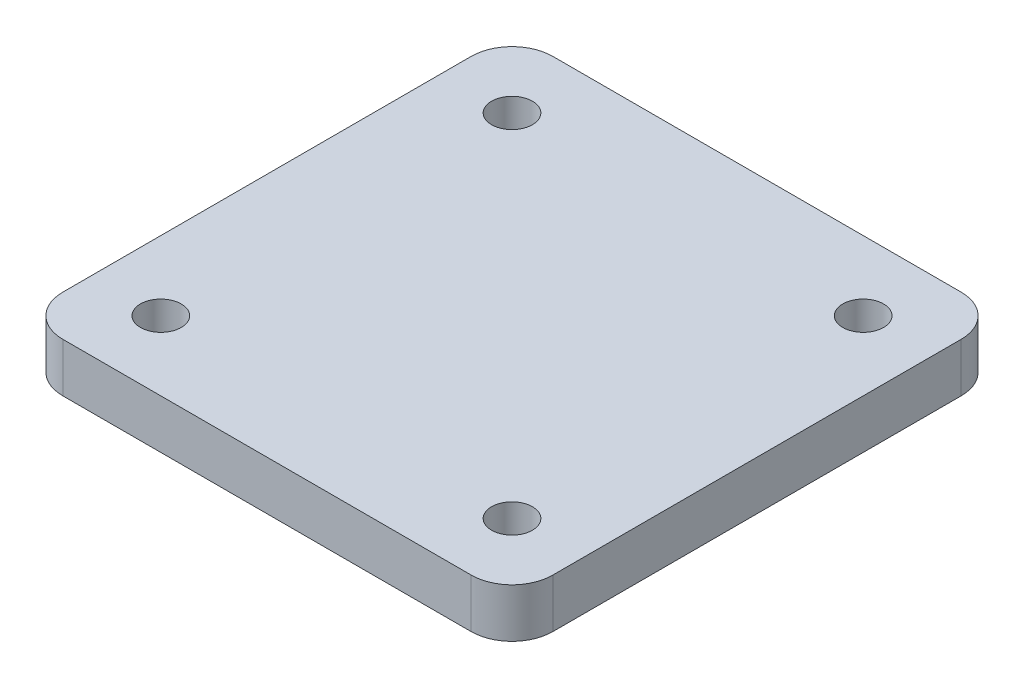
ISO-10303-21;
HEADER;
FILE_DESCRIPTION(('STEP AP214'),'2;1');
FILE_NAME('part.step','',(''),(''),'','','');
FILE_SCHEMA(('AUTOMOTIVE_DESIGN { 1 0 10303 214 1 1 1 1 }'));
ENDSEC;
DATA;
#1=APPLICATION_CONTEXT('core data for automotive mechanical design processes');
#2=APPLICATION_PROTOCOL_DEFINITION('international standard','automotive_design',2000,#1);
#3=PRODUCT_CONTEXT('',#1,'mechanical');
#4=PRODUCT('Part','Part','',(#3));
#5=PRODUCT_RELATED_PRODUCT_CATEGORY('part','',(#4));
#6=PRODUCT_DEFINITION_FORMATION('','',#4);
#7=PRODUCT_DEFINITION_CONTEXT('part definition',#1,'design');
#8=PRODUCT_DEFINITION('design','',#6,#7);
#9=PRODUCT_DEFINITION_SHAPE('','',#8);
#10=(LENGTH_UNIT() NAMED_UNIT(*) SI_UNIT(.MILLI.,.METRE.));
#11=(NAMED_UNIT(*) PLANE_ANGLE_UNIT() SI_UNIT($,.RADIAN.));
#12=(NAMED_UNIT(*) SI_UNIT($,.STERADIAN.) SOLID_ANGLE_UNIT());
#13=UNCERTAINTY_MEASURE_WITH_UNIT(LENGTH_MEASURE(1.E-05),#10,'distance_accuracy_value','');
#14=(GEOMETRIC_REPRESENTATION_CONTEXT(3) GLOBAL_UNCERTAINTY_ASSIGNED_CONTEXT((#13)) GLOBAL_UNIT_ASSIGNED_CONTEXT((#10,
#11,#12)) REPRESENTATION_CONTEXT('',''));
#15=CARTESIAN_POINT('',(0.,0.,0.));
#16=DIRECTION('',(0.,0.,1.));
#17=DIRECTION('',(1.,0.,0.));
#18=AXIS2_PLACEMENT_3D('',#15,#16,#17);
#19=CARTESIAN_POINT('',(-55.,6.,-4.99999999999999));
#20=DIRECTION('',(0.,-1.,0.));
#21=DIRECTION('',(0.,0.,-1.));
#22=AXIS2_PLACEMENT_3D('',#19,#20,#21);
#23=PLANE('',#22);
#24=CARTESIAN_POINT('',(-55.,6.,-4.99999999999999));
#25=DIRECTION('',(0.,1.,0.));
#26=DIRECTION('',(0.,0.,-1.));
#27=AXIS2_PLACEMENT_3D('',#24,#25,#26);
#28=CIRCLE('',#27,5.);
#29=CARTESIAN_POINT('',(-60.,6.,-5.00000000000003));
#30=VERTEX_POINT('',#29);
#31=CARTESIAN_POINT('',(-55.,6.,0.));
#32=VERTEX_POINT('',#31);
#33=EDGE_CURVE('E154',#30,#32,#28,.T.);
#34=ORIENTED_EDGE('',*,*,#33,.T.);
#35=DIRECTION('',(1.,0.,0.));
#36=VECTOR('',#35,1.);
#37=CARTESIAN_POINT('',(-5.00000000000004,6.,0.));
#38=LINE('',#37,#36);
#39=CARTESIAN_POINT('',(-5.00000000000004,6.,0.));
#40=VERTEX_POINT('',#39);
#41=EDGE_CURVE('E95',#32,#40,#38,.T.);
#42=ORIENTED_EDGE('',*,*,#41,.T.);
#43=CARTESIAN_POINT('',(-5.,6.,-5.));
#44=DIRECTION('',(0.,1.,0.));
#45=DIRECTION('',(0.,0.,1.));
#46=AXIS2_PLACEMENT_3D('',#43,#44,#45);
#47=CIRCLE('',#46,5.);
#48=CARTESIAN_POINT('',(0.,6.,-5.00000000000003));
#49=VERTEX_POINT('',#48);
#50=EDGE_CURVE('E164',#40,#49,#47,.T.);
#51=ORIENTED_EDGE('',*,*,#50,.T.);
#52=DIRECTION('',(0.,0.,-1.));
#53=VECTOR('',#52,1.);
#54=CARTESIAN_POINT('',(0.,6.,-5.00000000000004));
#55=LINE('',#54,#53);
#56=CARTESIAN_POINT('',(0.,6.,-55.));
#57=VERTEX_POINT('',#56);
#58=EDGE_CURVE('E166',#49,#57,#55,.T.);
#59=ORIENTED_EDGE('',*,*,#58,.T.);
#60=CARTESIAN_POINT('',(-5.,6.,-55.));
#61=DIRECTION('',(0.,1.,0.));
#62=DIRECTION('',(0.,0.,1.));
#63=AXIS2_PLACEMENT_3D('',#60,#61,#62);
#64=CIRCLE('',#63,5.);
#65=CARTESIAN_POINT('',(-5.00000000000003,6.,-60.));
#66=VERTEX_POINT('',#65);
#67=EDGE_CURVE('E114',#57,#66,#64,.T.);
#68=ORIENTED_EDGE('',*,*,#67,.T.);
#69=DIRECTION('',(-1.,0.,0.));
#70=VECTOR('',#69,1.);
#71=CARTESIAN_POINT('',(-5.00000000000004,6.,-60.));
#72=LINE('',#71,#70);
#73=CARTESIAN_POINT('',(-55.,6.,-60.));
#74=VERTEX_POINT('',#73);
#75=EDGE_CURVE('E108',#66,#74,#72,.T.);
#76=ORIENTED_EDGE('',*,*,#75,.T.);
#77=CARTESIAN_POINT('',(-55.,6.,-55.));
#78=DIRECTION('',(0.,1.,0.));
#79=DIRECTION('',(0.,0.,1.));
#80=AXIS2_PLACEMENT_3D('',#77,#78,#79);
#81=CIRCLE('',#80,5.);
#82=CARTESIAN_POINT('',(-60.,6.,-55.));
#83=VERTEX_POINT('',#82);
#84=EDGE_CURVE('E112',#74,#83,#81,.T.);
#85=ORIENTED_EDGE('',*,*,#84,.T.);
#86=DIRECTION('',(0.,0.,1.));
#87=VECTOR('',#86,1.);
#88=CARTESIAN_POINT('',(-60.,6.,-5.00000000000003));
#89=LINE('',#88,#87);
#90=EDGE_CURVE('E52',#83,#30,#89,.T.);
#91=ORIENTED_EDGE('',*,*,#90,.T.);
#92=EDGE_LOOP('',(#34,#42,#51,#59,#68,#76,#85,#91));
#93=FACE_BOUND('',#92,.T.);
#94=CARTESIAN_POINT('',(-51.5,6.,-51.5));
#95=DIRECTION('',(0.,1.,0.));
#96=DIRECTION('',(0.,0.,1.));
#97=AXIS2_PLACEMENT_3D('',#94,#95,#96);
#98=CIRCLE('',#97,2.5);
#99=CARTESIAN_POINT('',(-51.5,6.,-49.));
#100=VERTEX_POINT('',#99);
#101=EDGE_CURVE('E143',#100,#100,#98,.T.);
#102=ORIENTED_EDGE('',*,*,#101,.F.);
#103=EDGE_LOOP('',(#102));
#104=FACE_BOUND('',#103,.T.);
#105=CARTESIAN_POINT('',(-8.5,6.,-51.5));
#106=DIRECTION('',(0.,1.,0.));
#107=DIRECTION('',(0.,0.,1.));
#108=AXIS2_PLACEMENT_3D('',#105,#106,#107);
#109=CIRCLE('',#108,2.5);
#110=CARTESIAN_POINT('',(-8.5,6.,-49.));
#111=VERTEX_POINT('',#110);
#112=EDGE_CURVE('E153',#111,#111,#109,.T.);
#113=ORIENTED_EDGE('',*,*,#112,.F.);
#114=EDGE_LOOP('',(#113));
#115=FACE_BOUND('',#114,.T.);
#116=CARTESIAN_POINT('',(-8.5,6.,-8.5));
#117=DIRECTION('',(0.,1.,0.));
#118=DIRECTION('',(0.,0.,1.));
#119=AXIS2_PLACEMENT_3D('',#116,#117,#118);
#120=CIRCLE('',#119,2.5);
#121=CARTESIAN_POINT('',(-8.5,6.,-6.));
#122=VERTEX_POINT('',#121);
#123=EDGE_CURVE('E344',#122,#122,#120,.T.);
#124=ORIENTED_EDGE('',*,*,#123,.F.);
#125=EDGE_LOOP('',(#124));
#126=FACE_BOUND('',#125,.T.);
#127=CARTESIAN_POINT('',(-51.5,6.,-8.5));
#128=DIRECTION('',(0.,1.,0.));
#129=DIRECTION('',(0.,0.,1.));
#130=AXIS2_PLACEMENT_3D('',#127,#128,#129);
#131=CIRCLE('',#130,2.5);
#132=CARTESIAN_POINT('',(-51.5,6.,-6.));
#133=VERTEX_POINT('',#132);
#134=EDGE_CURVE('E335',#133,#133,#131,.T.);
#135=ORIENTED_EDGE('',*,*,#134,.F.);
#136=EDGE_LOOP('',(#135));
#137=FACE_BOUND('',#136,.T.);
#138=ADVANCED_FACE('F35',(#93,#104,#115,#126,#137),#23,.F.);
#139=CARTESIAN_POINT('',(-55.,0.,-4.99999999999999));
#140=DIRECTION('',(0.,-1.,0.));
#141=DIRECTION('',(0.,0.,-1.));
#142=AXIS2_PLACEMENT_3D('',#139,#140,#141);
#143=PLANE('',#142);
#144=CARTESIAN_POINT('',(-8.5,0.,-8.5));
#145=DIRECTION('',(0.,1.,0.));
#146=DIRECTION('',(0.,0.,1.));
#147=AXIS2_PLACEMENT_3D('',#144,#145,#146);
#148=CIRCLE('',#147,2.5);
#149=CARTESIAN_POINT('',(-8.5,0.,-6.));
#150=VERTEX_POINT('',#149);
#151=EDGE_CURVE('E341',#150,#150,#148,.T.);
#152=ORIENTED_EDGE('',*,*,#151,.T.);
#153=EDGE_LOOP('',(#152));
#154=FACE_BOUND('',#153,.T.);
#155=CARTESIAN_POINT('',(-51.5,0.,-51.5));
#156=DIRECTION('',(0.,1.,0.));
#157=DIRECTION('',(0.,0.,1.));
#158=AXIS2_PLACEMENT_3D('',#155,#156,#157);
#159=CIRCLE('',#158,2.5);
#160=CARTESIAN_POINT('',(-51.5,0.,-49.));
#161=VERTEX_POINT('',#160);
#162=EDGE_CURVE('E149',#161,#161,#159,.T.);
#163=ORIENTED_EDGE('',*,*,#162,.T.);
#164=EDGE_LOOP('',(#163));
#165=FACE_BOUND('',#164,.T.);
#166=CARTESIAN_POINT('',(-55.,0.,-4.99999999999999));
#167=DIRECTION('',(0.,1.,0.));
#168=DIRECTION('',(0.,0.,-1.));
#169=AXIS2_PLACEMENT_3D('',#166,#167,#168);
#170=CIRCLE('',#169,5.);
#171=CARTESIAN_POINT('',(-60.,0.,-5.00000000000003));
#172=VERTEX_POINT('',#171);
#173=CARTESIAN_POINT('',(-55.,0.,0.));
#174=VERTEX_POINT('',#173);
#175=EDGE_CURVE('E148',#172,#174,#170,.T.);
#176=ORIENTED_EDGE('',*,*,#175,.F.);
#177=DIRECTION('',(0.,0.,1.));
#178=VECTOR('',#177,1.);
#179=CARTESIAN_POINT('',(-60.,0.,-5.00000000000003));
#180=LINE('',#179,#178);
#181=CARTESIAN_POINT('',(-60.,0.,-55.));
#182=VERTEX_POINT('',#181);
#183=EDGE_CURVE('E87',#182,#172,#180,.T.);
#184=ORIENTED_EDGE('',*,*,#183,.F.);
#185=CARTESIAN_POINT('',(-55.,0.,-55.));
#186=DIRECTION('',(0.,1.,0.));
#187=DIRECTION('',(0.,0.,1.));
#188=AXIS2_PLACEMENT_3D('',#185,#186,#187);
#189=CIRCLE('',#188,5.);
#190=CARTESIAN_POINT('',(-55.,0.,-60.));
#191=VERTEX_POINT('',#190);
#192=EDGE_CURVE('E81',#191,#182,#189,.T.);
#193=ORIENTED_EDGE('',*,*,#192,.F.);
#194=DIRECTION('',(-1.,0.,0.));
#195=VECTOR('',#194,1.);
#196=CARTESIAN_POINT('',(-5.00000000000004,0.,-60.));
#197=LINE('',#196,#195);
#198=CARTESIAN_POINT('',(-5.00000000000003,0.,-60.));
#199=VERTEX_POINT('',#198);
#200=EDGE_CURVE('E122',#199,#191,#197,.T.);
#201=ORIENTED_EDGE('',*,*,#200,.F.);
#202=CARTESIAN_POINT('',(-5.,0.,-55.));
#203=DIRECTION('',(0.,1.,0.));
#204=DIRECTION('',(0.,0.,1.));
#205=AXIS2_PLACEMENT_3D('',#202,#203,#204);
#206=CIRCLE('',#205,5.);
#207=CARTESIAN_POINT('',(0.,0.,-55.));
#208=VERTEX_POINT('',#207);
#209=EDGE_CURVE('E185',#208,#199,#206,.T.);
#210=ORIENTED_EDGE('',*,*,#209,.F.);
#211=DIRECTION('',(0.,0.,-1.));
#212=VECTOR('',#211,1.);
#213=CARTESIAN_POINT('',(0.,0.,-5.00000000000004));
#214=LINE('',#213,#212);
#215=CARTESIAN_POINT('',(0.,0.,-5.00000000000003));
#216=VERTEX_POINT('',#215);
#217=EDGE_CURVE('E179',#216,#208,#214,.T.);
#218=ORIENTED_EDGE('',*,*,#217,.F.);
#219=CARTESIAN_POINT('',(-5.,0.,-5.));
#220=DIRECTION('',(0.,1.,0.));
#221=DIRECTION('',(0.,0.,1.));
#222=AXIS2_PLACEMENT_3D('',#219,#220,#221);
#223=CIRCLE('',#222,5.);
#224=CARTESIAN_POINT('',(-5.00000000000004,0.,0.));
#225=VERTEX_POINT('',#224);
#226=EDGE_CURVE('E193',#225,#216,#223,.T.);
#227=ORIENTED_EDGE('',*,*,#226,.F.);
#228=DIRECTION('',(1.,0.,0.));
#229=VECTOR('',#228,1.);
#230=CARTESIAN_POINT('',(-5.00000000000004,0.,0.));
#231=LINE('',#230,#229);
#232=EDGE_CURVE('E198',#174,#225,#231,.T.);
#233=ORIENTED_EDGE('',*,*,#232,.F.);
#234=EDGE_LOOP('',(#176,#184,#193,#201,#210,#218,#227,#233));
#235=FACE_BOUND('',#234,.T.);
#236=CARTESIAN_POINT('',(-8.5,0.,-51.5));
#237=DIRECTION('',(0.,1.,0.));
#238=DIRECTION('',(0.,0.,1.));
#239=AXIS2_PLACEMENT_3D('',#236,#237,#238);
#240=CIRCLE('',#239,2.5);
#241=CARTESIAN_POINT('',(-8.5,0.,-49.));
#242=VERTEX_POINT('',#241);
#243=EDGE_CURVE('E150',#242,#242,#240,.T.);
#244=ORIENTED_EDGE('',*,*,#243,.T.);
#245=EDGE_LOOP('',(#244));
#246=FACE_BOUND('',#245,.T.);
#247=CARTESIAN_POINT('',(-51.5,0.,-8.5));
#248=DIRECTION('',(0.,1.,0.));
#249=DIRECTION('',(0.,0.,1.));
#250=AXIS2_PLACEMENT_3D('',#247,#248,#249);
#251=CIRCLE('',#250,2.5);
#252=CARTESIAN_POINT('',(-51.5,0.,-6.));
#253=VERTEX_POINT('',#252);
#254=EDGE_CURVE('E338',#253,#253,#251,.T.);
#255=ORIENTED_EDGE('',*,*,#254,.T.);
#256=EDGE_LOOP('',(#255));
#257=FACE_BOUND('',#256,.T.);
#258=ADVANCED_FACE('F196',(#154,#165,#235,#246,#257),#143,.T.);
#259=CARTESIAN_POINT('',(-55.,6.,-4.99999999999999));
#260=DIRECTION('',(0.,-1.,0.));
#261=DIRECTION('',(0.,0.,-1.));
#262=AXIS2_PLACEMENT_3D('',#259,#260,#261);
#263=CYLINDRICAL_SURFACE('',#262,5.);
#264=ORIENTED_EDGE('',*,*,#175,.T.);
#265=DIRECTION('',(0.,-1.,0.));
#266=VECTOR('',#265,1.);
#267=CARTESIAN_POINT('',(-55.,6.,0.));
#268=LINE('',#267,#266);
#269=EDGE_CURVE('E12',#32,#174,#268,.T.);
#270=ORIENTED_EDGE('',*,*,#269,.F.);
#271=ORIENTED_EDGE('',*,*,#33,.F.);
#272=DIRECTION('',(0.,-1.,0.));
#273=VECTOR('',#272,1.);
#274=CARTESIAN_POINT('',(-60.,6.,-5.00000000000003));
#275=LINE('',#274,#273);
#276=EDGE_CURVE('E128',#30,#172,#275,.T.);
#277=ORIENTED_EDGE('',*,*,#276,.T.);
#278=EDGE_LOOP('',(#264,#270,#271,#277));
#279=FACE_BOUND('',#278,.T.);
#280=ADVANCED_FACE('F37',(#279),#263,.T.);
#281=CARTESIAN_POINT('',(-5.00000000000004,6.,0.));
#282=DIRECTION('',(0.,0.,-1.));
#283=DIRECTION('',(-1.,0.,0.));
#284=AXIS2_PLACEMENT_3D('',#281,#282,#283);
#285=PLANE('',#284);
#286=ORIENTED_EDGE('',*,*,#232,.T.);
#287=DIRECTION('',(0.,-1.,0.));
#288=VECTOR('',#287,1.);
#289=CARTESIAN_POINT('',(-5.00000000000004,6.,0.));
#290=LINE('',#289,#288);
#291=EDGE_CURVE('E44',#40,#225,#290,.T.);
#292=ORIENTED_EDGE('',*,*,#291,.F.);
#293=ORIENTED_EDGE('',*,*,#41,.F.);
#294=ORIENTED_EDGE('',*,*,#269,.T.);
#295=EDGE_LOOP('',(#286,#292,#293,#294));
#296=FACE_BOUND('',#295,.T.);
#297=ADVANCED_FACE('F212',(#296),#285,.F.);
#298=CARTESIAN_POINT('',(-5.,6.,-5.));
#299=DIRECTION('',(0.,-1.,0.));
#300=DIRECTION('',(0.,0.,-1.));
#301=AXIS2_PLACEMENT_3D('',#298,#299,#300);
#302=CYLINDRICAL_SURFACE('',#301,5.);
#303=ORIENTED_EDGE('',*,*,#226,.T.);
#304=DIRECTION('',(0.,-1.,0.));
#305=VECTOR('',#304,1.);
#306=CARTESIAN_POINT('',(0.,6.,-5.00000000000003));
#307=LINE('',#306,#305);
#308=EDGE_CURVE('E182',#49,#216,#307,.T.);
#309=ORIENTED_EDGE('',*,*,#308,.F.);
#310=ORIENTED_EDGE('',*,*,#50,.F.);
#311=ORIENTED_EDGE('',*,*,#291,.T.);
#312=EDGE_LOOP('',(#303,#309,#310,#311));
#313=FACE_BOUND('',#312,.T.);
#314=ADVANCED_FACE('F192',(#313),#302,.T.);
#315=CARTESIAN_POINT('',(0.,6.,-5.00000000000004));
#316=DIRECTION('',(-1.,0.,0.));
#317=DIRECTION('',(0.,0.,1.));
#318=AXIS2_PLACEMENT_3D('',#315,#316,#317);
#319=PLANE('',#318);
#320=ORIENTED_EDGE('',*,*,#217,.T.);
#321=DIRECTION('',(0.,-1.,0.));
#322=VECTOR('',#321,1.);
#323=CARTESIAN_POINT('',(0.,6.,-55.));
#324=LINE('',#323,#322);
#325=EDGE_CURVE('E176',#57,#208,#324,.T.);
#326=ORIENTED_EDGE('',*,*,#325,.F.);
#327=ORIENTED_EDGE('',*,*,#58,.F.);
#328=ORIENTED_EDGE('',*,*,#308,.T.);
#329=EDGE_LOOP('',(#320,#326,#327,#328));
#330=FACE_BOUND('',#329,.T.);
#331=ADVANCED_FACE('F177',(#330),#319,.F.);
#332=CARTESIAN_POINT('',(-5.,6.,-55.));
#333=DIRECTION('',(0.,-1.,0.));
#334=DIRECTION('',(0.,0.,-1.));
#335=AXIS2_PLACEMENT_3D('',#332,#333,#334);
#336=CYLINDRICAL_SURFACE('',#335,5.);
#337=ORIENTED_EDGE('',*,*,#209,.T.);
#338=DIRECTION('',(0.,-1.,0.));
#339=VECTOR('',#338,1.);
#340=CARTESIAN_POINT('',(-5.00000000000003,6.,-60.));
#341=LINE('',#340,#339);
#342=EDGE_CURVE('E123',#66,#199,#341,.T.);
#343=ORIENTED_EDGE('',*,*,#342,.F.);
#344=ORIENTED_EDGE('',*,*,#67,.F.);
#345=ORIENTED_EDGE('',*,*,#325,.T.);
#346=EDGE_LOOP('',(#337,#343,#344,#345));
#347=FACE_BOUND('',#346,.T.);
#348=ADVANCED_FACE('F184',(#347),#336,.T.);
#349=CARTESIAN_POINT('',(-5.00000000000004,6.,-60.));
#350=DIRECTION('',(0.,0.,1.));
#351=DIRECTION('',(1.,0.,0.));
#352=AXIS2_PLACEMENT_3D('',#349,#350,#351);
#353=PLANE('',#352);
#354=ORIENTED_EDGE('',*,*,#200,.T.);
#355=DIRECTION('',(0.,-1.,0.));
#356=VECTOR('',#355,1.);
#357=CARTESIAN_POINT('',(-55.,6.,-60.));
#358=LINE('',#357,#356);
#359=EDGE_CURVE('E119',#74,#191,#358,.T.);
#360=ORIENTED_EDGE('',*,*,#359,.F.);
#361=ORIENTED_EDGE('',*,*,#75,.F.);
#362=ORIENTED_EDGE('',*,*,#342,.T.);
#363=EDGE_LOOP('',(#354,#360,#361,#362));
#364=FACE_BOUND('',#363,.T.);
#365=ADVANCED_FACE('F120',(#364),#353,.F.);
#366=CARTESIAN_POINT('',(-55.,6.,-55.));
#367=DIRECTION('',(0.,-1.,0.));
#368=DIRECTION('',(0.,0.,-1.));
#369=AXIS2_PLACEMENT_3D('',#366,#367,#368);
#370=CYLINDRICAL_SURFACE('',#369,5.);
#371=ORIENTED_EDGE('',*,*,#192,.T.);
#372=DIRECTION('',(0.,-1.,0.));
#373=VECTOR('',#372,1.);
#374=CARTESIAN_POINT('',(-60.,6.,-55.));
#375=LINE('',#374,#373);
#376=EDGE_CURVE('E124',#83,#182,#375,.T.);
#377=ORIENTED_EDGE('',*,*,#376,.F.);
#378=ORIENTED_EDGE('',*,*,#84,.F.);
#379=ORIENTED_EDGE('',*,*,#359,.T.);
#380=EDGE_LOOP('',(#371,#377,#378,#379));
#381=FACE_BOUND('',#380,.T.);
#382=ADVANCED_FACE('F126',(#381),#370,.T.);
#383=CARTESIAN_POINT('',(-60.,6.,-5.00000000000003));
#384=DIRECTION('',(1.,0.,0.));
#385=DIRECTION('',(0.,0.,-1.));
#386=AXIS2_PLACEMENT_3D('',#383,#384,#385);
#387=PLANE('',#386);
#388=ORIENTED_EDGE('',*,*,#183,.T.);
#389=ORIENTED_EDGE('',*,*,#276,.F.);
#390=ORIENTED_EDGE('',*,*,#90,.F.);
#391=ORIENTED_EDGE('',*,*,#376,.T.);
#392=EDGE_LOOP('',(#388,#389,#390,#391));
#393=FACE_BOUND('',#392,.T.);
#394=ADVANCED_FACE('F207',(#393),#387,.F.);
#395=CARTESIAN_POINT('',(-51.5,6.,-51.5));
#396=DIRECTION('',(0.,-1.,0.));
#397=DIRECTION('',(0.,0.,-1.));
#398=AXIS2_PLACEMENT_3D('',#395,#396,#397);
#399=CYLINDRICAL_SURFACE('',#398,2.5);
#400=ORIENTED_EDGE('',*,*,#101,.T.);
#401=EDGE_LOOP('',(#400));
#402=FACE_BOUND('',#401,.T.);
#403=ORIENTED_EDGE('',*,*,#162,.F.);
#404=EDGE_LOOP('',(#403));
#405=FACE_BOUND('',#404,.T.);
#406=ADVANCED_FACE('F227',(#402,#405),#399,.F.);
#407=CARTESIAN_POINT('',(-8.5,6.,-51.5));
#408=DIRECTION('',(0.,-1.,0.));
#409=DIRECTION('',(0.,0.,-1.));
#410=AXIS2_PLACEMENT_3D('',#407,#408,#409);
#411=CYLINDRICAL_SURFACE('',#410,2.5);
#412=ORIENTED_EDGE('',*,*,#112,.T.);
#413=EDGE_LOOP('',(#412));
#414=FACE_BOUND('',#413,.T.);
#415=ORIENTED_EDGE('',*,*,#243,.F.);
#416=EDGE_LOOP('',(#415));
#417=FACE_BOUND('',#416,.T.);
#418=ADVANCED_FACE('F265',(#414,#417),#411,.F.);
#419=CARTESIAN_POINT('',(-8.5,6.,-8.5));
#420=DIRECTION('',(0.,-1.,0.));
#421=DIRECTION('',(0.,0.,-1.));
#422=AXIS2_PLACEMENT_3D('',#419,#420,#421);
#423=CYLINDRICAL_SURFACE('',#422,2.5);
#424=ORIENTED_EDGE('',*,*,#123,.T.);
#425=EDGE_LOOP('',(#424));
#426=FACE_BOUND('',#425,.T.);
#427=ORIENTED_EDGE('',*,*,#151,.F.);
#428=EDGE_LOOP('',(#427));
#429=FACE_BOUND('',#428,.T.);
#430=ADVANCED_FACE('F272',(#426,#429),#423,.F.);
#431=CARTESIAN_POINT('',(-51.5,6.,-8.5));
#432=DIRECTION('',(0.,-1.,0.));
#433=DIRECTION('',(0.,0.,-1.));
#434=AXIS2_PLACEMENT_3D('',#431,#432,#433);
#435=CYLINDRICAL_SURFACE('',#434,2.5);
#436=ORIENTED_EDGE('',*,*,#134,.T.);
#437=EDGE_LOOP('',(#436));
#438=FACE_BOUND('',#437,.T.);
#439=ORIENTED_EDGE('',*,*,#254,.F.);
#440=EDGE_LOOP('',(#439));
#441=FACE_BOUND('',#440,.T.);
#442=ADVANCED_FACE('F279',(#438,#441),#435,.F.);
#443=CLOSED_SHELL('',(#138,#258,#280,#297,#314,#331,#348,#365,#382,#394,#406,#418,#430,#442));
#444=MANIFOLD_SOLID_BREP('B2',#443);
#445=ADVANCED_BREP_SHAPE_REPRESENTATION('',(#18,#444),#14);
#446=SHAPE_DEFINITION_REPRESENTATION(#9,#445);
ENDSEC;
END-ISO-10303-21;
